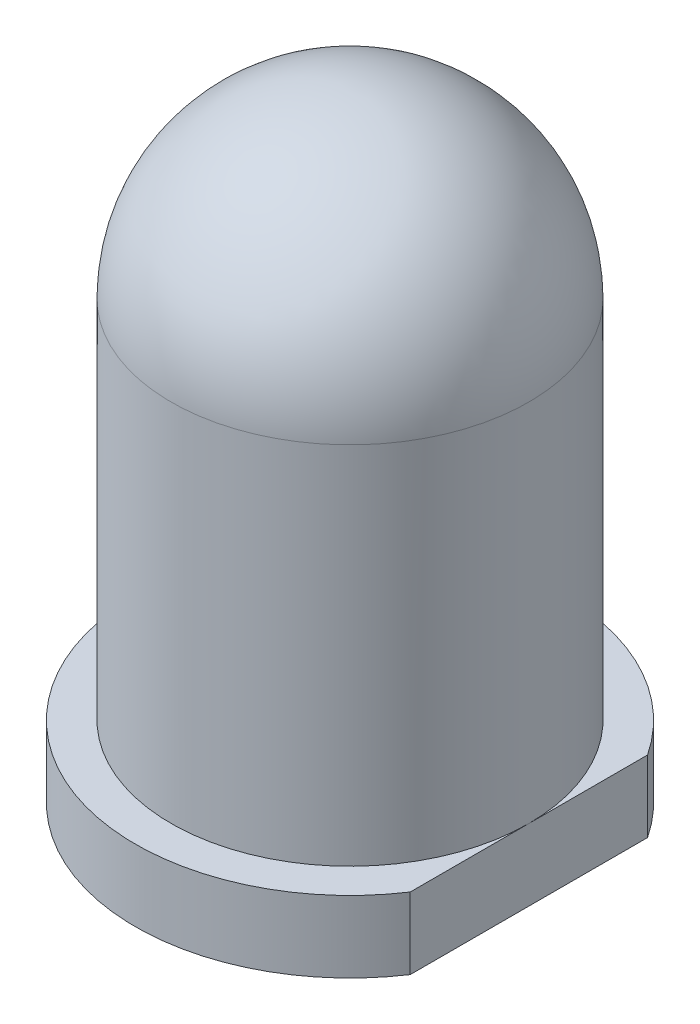
ISO-10303-21;
HEADER;
FILE_DESCRIPTION(('STEP AP214'),'2;1');
FILE_NAME('part.step','',(''),(''),'','','');
FILE_SCHEMA(('AUTOMOTIVE_DESIGN { 1 0 10303 214 1 1 1 1 }'));
ENDSEC;
DATA;
#1=APPLICATION_CONTEXT('core data for automotive mechanical design processes');
#2=APPLICATION_PROTOCOL_DEFINITION('international standard','automotive_design',2000,#1);
#3=PRODUCT_CONTEXT('',#1,'mechanical');
#4=PRODUCT('Part','Part','',(#3));
#5=PRODUCT_RELATED_PRODUCT_CATEGORY('part','',(#4));
#6=PRODUCT_DEFINITION_FORMATION('','',#4);
#7=PRODUCT_DEFINITION_CONTEXT('part definition',#1,'design');
#8=PRODUCT_DEFINITION('design','',#6,#7);
#9=PRODUCT_DEFINITION_SHAPE('','',#8);
#10=(LENGTH_UNIT() NAMED_UNIT(*) SI_UNIT(.MILLI.,.METRE.));
#11=(NAMED_UNIT(*) PLANE_ANGLE_UNIT() SI_UNIT($,.RADIAN.));
#12=(NAMED_UNIT(*) SI_UNIT($,.STERADIAN.) SOLID_ANGLE_UNIT());
#13=UNCERTAINTY_MEASURE_WITH_UNIT(LENGTH_MEASURE(1.E-05),#10,'distance_accuracy_value','');
#14=(GEOMETRIC_REPRESENTATION_CONTEXT(3) GLOBAL_UNCERTAINTY_ASSIGNED_CONTEXT((#13)) GLOBAL_UNIT_ASSIGNED_CONTEXT((#10,
#11,#12)) REPRESENTATION_CONTEXT('',''));
#15=CARTESIAN_POINT('',(0.,0.,0.));
#16=DIRECTION('',(0.,0.,1.));
#17=DIRECTION('',(1.,0.,0.));
#18=AXIS2_PLACEMENT_3D('',#15,#16,#17);
#19=CARTESIAN_POINT('',(0.,0.,0.));
#20=DIRECTION('',(0.,1.,0.));
#21=DIRECTION('',(0.,0.,0.999999999999999));
#22=AXIS2_PLACEMENT_3D('',#19,#20,#21);
#23=PLANE('',#22);
#24=DIRECTION('',(0.,0.,0.999999999999999));
#25=VECTOR('',#24,1.);
#26=CARTESIAN_POINT('',(2.5,0.,-2.72516283734536));
#27=LINE('',#26,#25);
#28=CARTESIAN_POINT('',(2.5,0.,-1.65831239517769));
#29=VERTEX_POINT('',#28);
#30=CARTESIAN_POINT('',(2.49999999999999,0.,1.65831239517771));
#31=VERTEX_POINT('',#30);
#32=EDGE_CURVE('E65',#29,#31,#27,.T.);
#33=ORIENTED_EDGE('',*,*,#32,.T.);
#34=CARTESIAN_POINT('',(0.,0.,0.));
#35=DIRECTION('',(0.,-1.,0.));
#36=DIRECTION('',(0.,0.,-0.999999999999999));
#37=AXIS2_PLACEMENT_3D('',#34,#35,#36);
#38=CIRCLE('',#37,3.);
#39=EDGE_CURVE('E11',#31,#29,#38,.T.);
#40=ORIENTED_EDGE('',*,*,#39,.T.);
#41=EDGE_LOOP('',(#33,#40));
#42=FACE_BOUND('',#41,.T.);
#43=ADVANCED_FACE('F38',(#42),#23,.F.);
#44=CARTESIAN_POINT('',(0.,0.,0.));
#45=DIRECTION('',(0.,-1.,0.));
#46=DIRECTION('',(0.,0.,-0.999999999999999));
#47=AXIS2_PLACEMENT_3D('',#44,#45,#46);
#48=CYLINDRICAL_SURFACE('',#47,3.);
#49=DIRECTION('',(0.,-1.,0.));
#50=VECTOR('',#49,1.);
#51=CARTESIAN_POINT('',(2.49999999999999,0.,1.65831239517771));
#52=LINE('',#51,#50);
#53=CARTESIAN_POINT('',(2.49999999999996,1.,1.65831239517769));
#54=VERTEX_POINT('',#53);
#55=EDGE_CURVE('E68',#54,#31,#52,.T.);
#56=ORIENTED_EDGE('',*,*,#55,.F.);
#57=CARTESIAN_POINT('',(0.,1.,0.));
#58=DIRECTION('',(0.,-1.,0.));
#59=DIRECTION('',(0.,0.,-0.999999999999999));
#60=AXIS2_PLACEMENT_3D('',#57,#58,#59);
#61=CIRCLE('',#60,3.);
#62=CARTESIAN_POINT('',(2.5,1.,-1.65831239517772));
#63=VERTEX_POINT('',#62);
#64=EDGE_CURVE('E45',#54,#63,#61,.T.);
#65=ORIENTED_EDGE('',*,*,#64,.T.);
#66=DIRECTION('',(0.,-1.,0.));
#67=VECTOR('',#66,1.);
#68=CARTESIAN_POINT('',(2.5,0.,-1.65831239517769));
#69=LINE('',#68,#67);
#70=EDGE_CURVE('E57',#29,#63,#69,.F.);
#71=ORIENTED_EDGE('',*,*,#70,.F.);
#72=ORIENTED_EDGE('',*,*,#39,.F.);
#73=EDGE_LOOP('',(#56,#65,#71,#72));
#74=FACE_BOUND('',#73,.T.);
#75=ADVANCED_FACE('F75',(#74),#48,.T.);
#76=CARTESIAN_POINT('',(-3.,1.00000000000003,0.));
#77=DIRECTION('',(0.,-1.,0.));
#78=DIRECTION('',(0.,0.,-0.999999999999999));
#79=AXIS2_PLACEMENT_3D('',#76,#77,#78);
#80=PLANE('',#79);
#81=DIRECTION('',(0.,0.,0.999999999999999));
#82=VECTOR('',#81,1.);
#83=CARTESIAN_POINT('',(2.49999999999999,1.00000000000006,0.));
#84=LINE('',#83,#82);
#85=CARTESIAN_POINT('',(2.49999999999999,1.00000000000006,0.));
#86=VERTEX_POINT('',#85);
#87=EDGE_CURVE('E52',#63,#86,#84,.T.);
#88=ORIENTED_EDGE('',*,*,#87,.F.);
#89=ORIENTED_EDGE('',*,*,#64,.F.);
#90=EDGE_CURVE('E71',#86,#54,#84,.T.);
#91=ORIENTED_EDGE('',*,*,#90,.F.);
#92=CARTESIAN_POINT('',(0.,1.,0.));
#93=DIRECTION('',(0.,-1.,0.));
#94=DIRECTION('',(0.,0.,-0.999999999999999));
#95=AXIS2_PLACEMENT_3D('',#92,#93,#94);
#96=CIRCLE('',#95,2.5);
#97=EDGE_CURVE('E122',#86,#86,#96,.T.);
#98=ORIENTED_EDGE('',*,*,#97,.T.);
#99=EDGE_LOOP('',(#88,#89,#91,#98));
#100=FACE_BOUND('',#99,.T.);
#101=ADVANCED_FACE('F83',(#100),#80,.F.);
#102=CARTESIAN_POINT('',(0.,0.,0.));
#103=DIRECTION('',(0.,-1.,0.));
#104=DIRECTION('',(0.,0.,-0.999999999999999));
#105=AXIS2_PLACEMENT_3D('',#102,#103,#104);
#106=CYLINDRICAL_SURFACE('',#105,2.5);
#107=ORIENTED_EDGE('',*,*,#97,.F.);
#108=EDGE_LOOP('',(#107));
#109=FACE_BOUND('',#108,.T.);
#110=CARTESIAN_POINT('',(0.,6.10000000000005,0.));
#111=DIRECTION('',(0.,-1.,0.));
#112=DIRECTION('',(0.,0.,-0.999999999999999));
#113=AXIS2_PLACEMENT_3D('',#110,#111,#112);
#114=CIRCLE('',#113,2.5);
#115=CARTESIAN_POINT('',(0.,6.10000000000005,-2.5));
#116=VERTEX_POINT('',#115);
#117=EDGE_CURVE('E77',#116,#116,#114,.T.);
#118=ORIENTED_EDGE('',*,*,#117,.T.);
#119=EDGE_LOOP('',(#118));
#120=FACE_BOUND('',#119,.T.);
#121=ADVANCED_FACE('F87',(#109,#120),#106,.T.);
#122=CARTESIAN_POINT('',(0.,6.10000000000005,0.));
#123=DIRECTION('',(0.,-1.,0.));
#124=DIRECTION('',(-1.,0.,0.));
#125=AXIS2_PLACEMENT_3D('',#122,#123,#124);
#126=SPHERICAL_SURFACE('',#125,2.5);
#127=ORIENTED_EDGE('',*,*,#117,.F.);
#128=EDGE_LOOP('',(#127));
#129=FACE_BOUND('',#128,.T.);
#130=ADVANCED_FACE('F93',(#129),#126,.T.);
#131=CARTESIAN_POINT('',(2.49999999999997,10.,-2.72516283734538));
#132=DIRECTION('',(1.,0.,0.));
#133=DIRECTION('',(0.,0.,-0.999999999999999));
#134=AXIS2_PLACEMENT_3D('',#131,#132,#133);
#135=PLANE('',#134);
#136=ORIENTED_EDGE('',*,*,#70,.T.);
#137=ORIENTED_EDGE('',*,*,#87,.T.);
#138=ORIENTED_EDGE('',*,*,#90,.T.);
#139=ORIENTED_EDGE('',*,*,#55,.T.);
#140=ORIENTED_EDGE('',*,*,#32,.F.);
#141=EDGE_LOOP('',(#136,#137,#138,#139,#140));
#142=FACE_BOUND('',#141,.T.);
#143=ADVANCED_FACE('F66',(#142),#135,.T.);
#144=CLOSED_SHELL('',(#43,#75,#101,#121,#130,#143));
#145=MANIFOLD_SOLID_BREP('B2',#144);
#146=ADVANCED_BREP_SHAPE_REPRESENTATION('',(#18,#145),#14);
#147=SHAPE_DEFINITION_REPRESENTATION(#9,#146);
ENDSEC;
END-ISO-10303-21;
